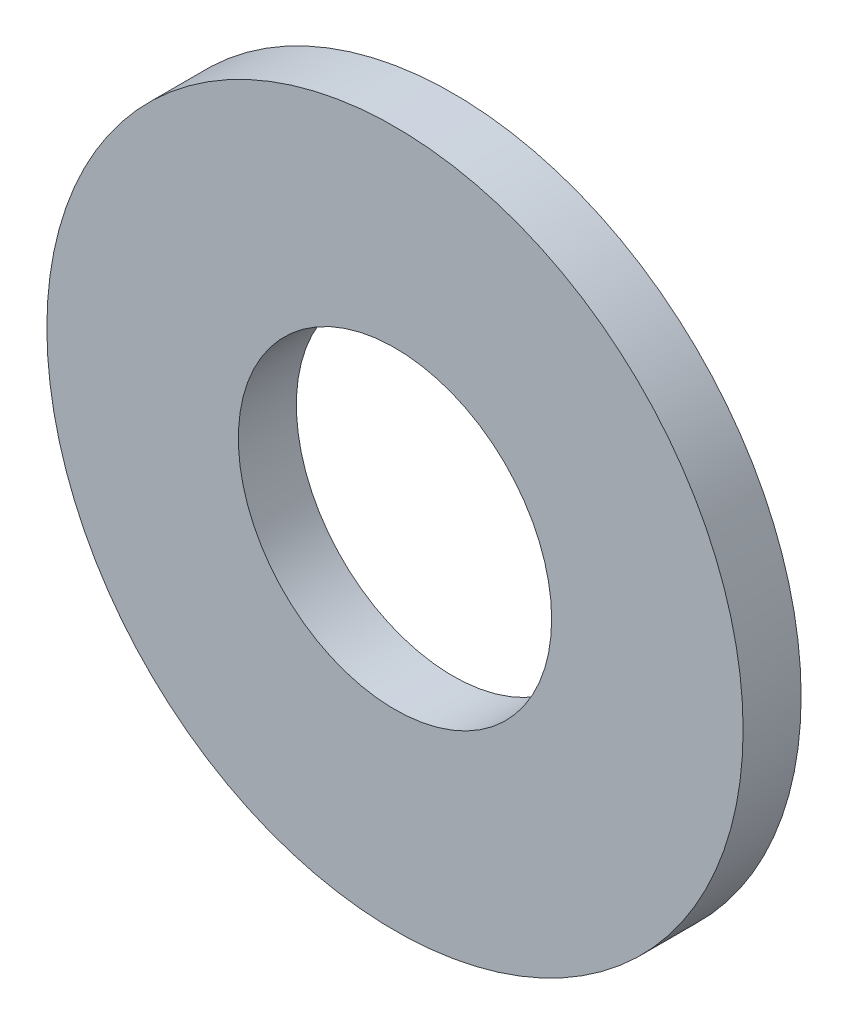
ISO-10303-21;
HEADER;
FILE_DESCRIPTION(('STEP AP214'),'2;1');
FILE_NAME('part.step','',(''),(''),'','','');
FILE_SCHEMA(('AUTOMOTIVE_DESIGN { 1 0 10303 214 1 1 1 1 }'));
ENDSEC;
DATA;
#1=APPLICATION_CONTEXT('core data for automotive mechanical design processes');
#2=APPLICATION_PROTOCOL_DEFINITION('international standard','automotive_design',2000,#1);
#3=PRODUCT_CONTEXT('',#1,'mechanical');
#4=PRODUCT('Part','Part','',(#3));
#5=PRODUCT_RELATED_PRODUCT_CATEGORY('part','',(#4));
#6=PRODUCT_DEFINITION_FORMATION('','',#4);
#7=PRODUCT_DEFINITION_CONTEXT('part definition',#1,'design');
#8=PRODUCT_DEFINITION('design','',#6,#7);
#9=PRODUCT_DEFINITION_SHAPE('','',#8);
#10=(LENGTH_UNIT() NAMED_UNIT(*) SI_UNIT(.MILLI.,.METRE.));
#11=(NAMED_UNIT(*) PLANE_ANGLE_UNIT() SI_UNIT($,.RADIAN.));
#12=(NAMED_UNIT(*) SI_UNIT($,.STERADIAN.) SOLID_ANGLE_UNIT());
#13=UNCERTAINTY_MEASURE_WITH_UNIT(LENGTH_MEASURE(1.E-05),#10,'distance_accuracy_value','');
#14=(GEOMETRIC_REPRESENTATION_CONTEXT(3) GLOBAL_UNCERTAINTY_ASSIGNED_CONTEXT((#13)) GLOBAL_UNIT_ASSIGNED_CONTEXT((#10,
#11,#12)) REPRESENTATION_CONTEXT('',''));
#15=CARTESIAN_POINT('',(0.,0.,0.));
#16=DIRECTION('',(0.,0.,1.));
#17=DIRECTION('',(1.,0.,0.));
#18=AXIS2_PLACEMENT_3D('',#15,#16,#17);
#19=CARTESIAN_POINT('',(0.,0.,0.5));
#20=DIRECTION('',(0.,0.,1.));
#21=DIRECTION('',(1.,0.,0.));
#22=AXIS2_PLACEMENT_3D('',#19,#20,#21);
#23=PLANE('',#22);
#24=CARTESIAN_POINT('',(0.,0.,0.5));
#25=DIRECTION('',(0.,0.,1.));
#26=DIRECTION('',(1.,0.,0.));
#27=AXIS2_PLACEMENT_3D('',#24,#25,#26);
#28=CIRCLE('',#27,3.);
#29=CARTESIAN_POINT('',(3.,0.,0.5));
#30=VERTEX_POINT('',#29);
#31=EDGE_CURVE('E10',#30,#30,#28,.T.);
#32=ORIENTED_EDGE('',*,*,#31,.T.);
#33=EDGE_LOOP('',(#32));
#34=FACE_BOUND('',#33,.T.);
#35=CARTESIAN_POINT('',(0.,0.,0.5));
#36=DIRECTION('',(0.,0.,1.));
#37=DIRECTION('',(1.,0.,0.));
#38=AXIS2_PLACEMENT_3D('',#35,#36,#37);
#39=CIRCLE('',#38,1.35);
#40=CARTESIAN_POINT('',(1.35,0.,0.5));
#41=VERTEX_POINT('',#40);
#42=EDGE_CURVE('E42',#41,#41,#39,.T.);
#43=ORIENTED_EDGE('',*,*,#42,.F.);
#44=EDGE_LOOP('',(#43));
#45=FACE_BOUND('',#44,.T.);
#46=ADVANCED_FACE('F31',(#34,#45),#23,.T.);
#47=CARTESIAN_POINT('',(0.,0.,0.));
#48=DIRECTION('',(0.,0.,1.));
#49=DIRECTION('',(1.,0.,0.));
#50=AXIS2_PLACEMENT_3D('',#47,#48,#49);
#51=PLANE('',#50);
#52=CARTESIAN_POINT('',(0.,0.,0.));
#53=DIRECTION('',(0.,0.,1.));
#54=DIRECTION('',(1.,0.,0.));
#55=AXIS2_PLACEMENT_3D('',#52,#53,#54);
#56=CIRCLE('',#55,3.);
#57=CARTESIAN_POINT('',(3.,0.,0.));
#58=VERTEX_POINT('',#57);
#59=EDGE_CURVE('E35',#58,#58,#56,.T.);
#60=ORIENTED_EDGE('',*,*,#59,.F.);
#61=EDGE_LOOP('',(#60));
#62=FACE_BOUND('',#61,.T.);
#63=CARTESIAN_POINT('',(0.,0.,0.));
#64=DIRECTION('',(0.,0.,1.));
#65=DIRECTION('',(1.,0.,0.));
#66=AXIS2_PLACEMENT_3D('',#63,#64,#65);
#67=CIRCLE('',#66,1.35);
#68=CARTESIAN_POINT('',(1.35,0.,0.));
#69=VERTEX_POINT('',#68);
#70=EDGE_CURVE('E44',#69,#69,#67,.T.);
#71=ORIENTED_EDGE('',*,*,#70,.T.);
#72=EDGE_LOOP('',(#71));
#73=FACE_BOUND('',#72,.T.);
#74=ADVANCED_FACE('F54',(#62,#73),#51,.F.);
#75=CARTESIAN_POINT('',(0.,0.,0.5));
#76=DIRECTION('',(0.,0.,-1.));
#77=DIRECTION('',(-1.,0.,0.));
#78=AXIS2_PLACEMENT_3D('',#75,#76,#77);
#79=CYLINDRICAL_SURFACE('',#78,3.);
#80=ORIENTED_EDGE('',*,*,#31,.F.);
#81=EDGE_LOOP('',(#80));
#82=FACE_BOUND('',#81,.T.);
#83=ORIENTED_EDGE('',*,*,#59,.T.);
#84=EDGE_LOOP('',(#83));
#85=FACE_BOUND('',#84,.T.);
#86=ADVANCED_FACE('F33',(#82,#85),#79,.T.);
#87=CARTESIAN_POINT('',(0.,0.,0.5));
#88=DIRECTION('',(0.,0.,-1.));
#89=DIRECTION('',(-1.,0.,0.));
#90=AXIS2_PLACEMENT_3D('',#87,#88,#89);
#91=CYLINDRICAL_SURFACE('',#90,1.35);
#92=ORIENTED_EDGE('',*,*,#42,.T.);
#93=EDGE_LOOP('',(#92));
#94=FACE_BOUND('',#93,.T.);
#95=ORIENTED_EDGE('',*,*,#70,.F.);
#96=EDGE_LOOP('',(#95));
#97=FACE_BOUND('',#96,.T.);
#98=ADVANCED_FACE('F50',(#94,#97),#91,.F.);
#99=CLOSED_SHELL('',(#46,#74,#86,#98));
#100=MANIFOLD_SOLID_BREP('B2',#99);
#101=ADVANCED_BREP_SHAPE_REPRESENTATION('',(#18,#100),#14);
#102=SHAPE_DEFINITION_REPRESENTATION(#9,#101);
ENDSEC;
END-ISO-10303-21;
